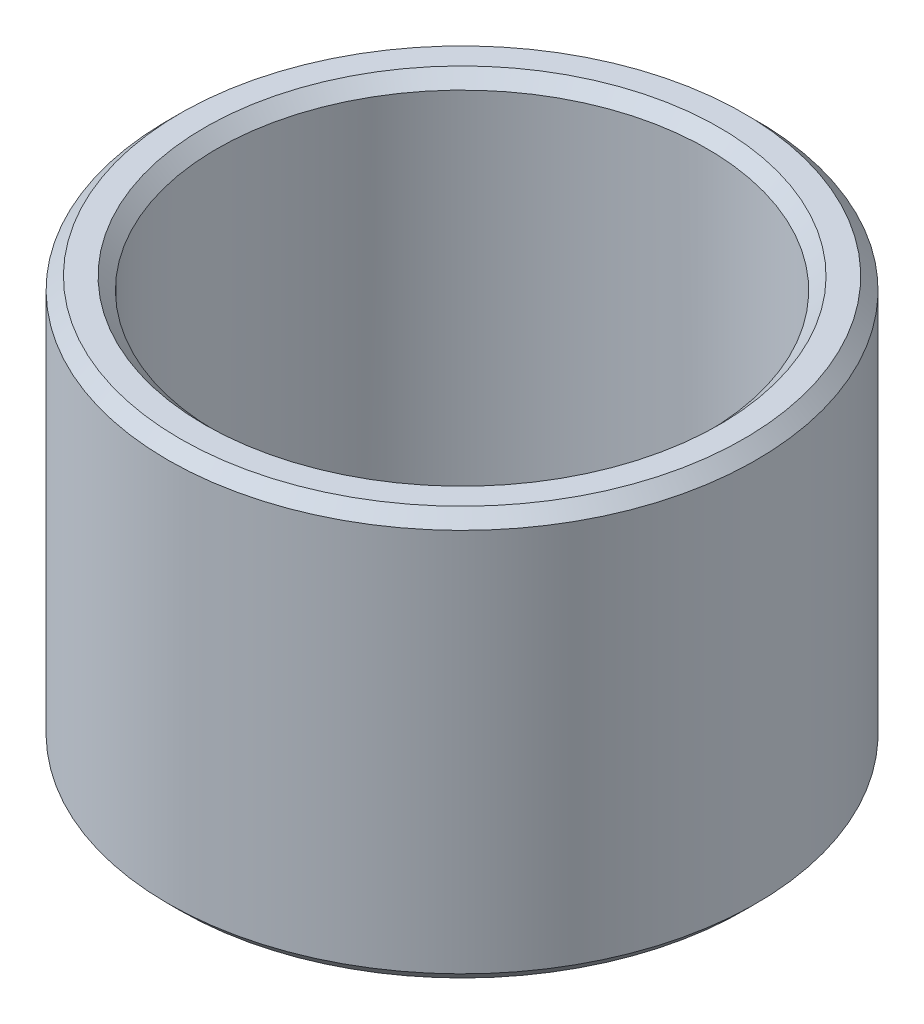
ISO-10303-21;
HEADER;
FILE_DESCRIPTION(('STEP AP214'),'2;1');
FILE_NAME('part.step','',(''),(''),'','','');
FILE_SCHEMA(('AUTOMOTIVE_DESIGN { 1 0 10303 214 1 1 1 1 }'));
ENDSEC;
DATA;
#1=APPLICATION_CONTEXT('core data for automotive mechanical design processes');
#2=APPLICATION_PROTOCOL_DEFINITION('international standard','automotive_design',2000,#1);
#3=PRODUCT_CONTEXT('',#1,'mechanical');
#4=PRODUCT('Part','Part','',(#3));
#5=PRODUCT_RELATED_PRODUCT_CATEGORY('part','',(#4));
#6=PRODUCT_DEFINITION_FORMATION('','',#4);
#7=PRODUCT_DEFINITION_CONTEXT('part definition',#1,'design');
#8=PRODUCT_DEFINITION('design','',#6,#7);
#9=PRODUCT_DEFINITION_SHAPE('','',#8);
#10=(LENGTH_UNIT() NAMED_UNIT(*) SI_UNIT(.MILLI.,.METRE.));
#11=(NAMED_UNIT(*) PLANE_ANGLE_UNIT() SI_UNIT($,.RADIAN.));
#12=(NAMED_UNIT(*) SI_UNIT($,.STERADIAN.) SOLID_ANGLE_UNIT());
#13=UNCERTAINTY_MEASURE_WITH_UNIT(LENGTH_MEASURE(1.E-05),#10,'distance_accuracy_value','');
#14=(GEOMETRIC_REPRESENTATION_CONTEXT(3) GLOBAL_UNCERTAINTY_ASSIGNED_CONTEXT((#13)) GLOBAL_UNIT_ASSIGNED_CONTEXT((#10,
#11,#12)) REPRESENTATION_CONTEXT('',''));
#15=CARTESIAN_POINT('',(0.,0.,0.));
#16=DIRECTION('',(0.,0.,1.));
#17=DIRECTION('',(1.,0.,0.));
#18=AXIS2_PLACEMENT_3D('',#15,#16,#17);
#19=CARTESIAN_POINT('',(0.,0.,0.));
#20=DIRECTION('',(0.,1.,0.));
#21=DIRECTION('',(0.,0.,1.00000000000004));
#22=AXIS2_PLACEMENT_3D('',#19,#20,#21);
#23=CYLINDRICAL_SURFACE('',#22,30.);
#24=CARTESIAN_POINT('',(0.,1.50000340784923,0.));
#25=DIRECTION('',(0.,-1.,0.));
#26=DIRECTION('',(-4.66199278501018E-10,0.,-1.00000000000004));
#27=AXIS2_PLACEMENT_3D('',#24,#25,#26);
#28=CIRCLE('',#27,30.0000034078484);
#29=CARTESIAN_POINT('',(-1.3985979943767E-08,1.50000340784923,-30.0000034078496));
#30=VERTEX_POINT('',#29);
#31=EDGE_CURVE('E32',#30,#30,#28,.T.);
#32=ORIENTED_EDGE('',*,*,#31,.T.);
#33=EDGE_LOOP('',(#32));
#34=FACE_BOUND('',#33,.T.);
#35=CARTESIAN_POINT('',(-1.11022302462516E-13,48.4999965921608,3.05311331771918E-13));
#36=DIRECTION('',(0.,1.,0.));
#37=DIRECTION('',(4.66198757716018E-10,0.,1.00000000000004));
#38=AXIS2_PLACEMENT_3D('',#35,#36,#37);
#39=CIRCLE('',#38,30.0000034078385);
#40=CARTESIAN_POINT('',(1.39858532979081E-08,48.4999965921608,30.0000034078399));
#41=VERTEX_POINT('',#40);
#42=EDGE_CURVE('E29',#41,#41,#39,.T.);
#43=ORIENTED_EDGE('',*,*,#42,.T.);
#44=EDGE_LOOP('',(#43));
#45=FACE_BOUND('',#44,.T.);
#46=ADVANCED_FACE('F14',(#34,#45),#23,.F.);
#47=CARTESIAN_POINT('',(0.,3.57824109231686E-06,0.));
#48=DIRECTION('',(0.,-1.,0.));
#49=DIRECTION('',(0.,0.,-1.00000000000004));
#50=AXIS2_PLACEMENT_3D('',#47,#48,#49);
#51=CONICAL_SURFACE('',#50,31.5000035782403,0.785398276992001);
#52=ORIENTED_EDGE('',*,*,#31,.F.);
#53=EDGE_LOOP('',(#52));
#54=FACE_BOUND('',#53,.T.);
#55=CARTESIAN_POINT('',(0.,0.,0.));
#56=DIRECTION('',(0.,1.,0.));
#57=DIRECTION('',(0.,0.,1.00000000000004));
#58=AXIS2_PLACEMENT_3D('',#55,#56,#57);
#59=CIRCLE('',#58,31.5000071564822);
#60=CARTESIAN_POINT('',(0.,0.,31.5000071564834));
#61=VERTEX_POINT('',#60);
#62=EDGE_CURVE('E17',#61,#61,#59,.F.);
#63=ORIENTED_EDGE('',*,*,#62,.T.);
#64=EDGE_LOOP('',(#63));
#65=FACE_BOUND('',#64,.T.);
#66=ADVANCED_FACE('F46',(#54,#65),#51,.F.);
#67=CARTESIAN_POINT('',(-1.11022302462516E-13,49.9999964217689,3.05311331771918E-13));
#68=DIRECTION('',(0.,1.,0.));
#69=DIRECTION('',(0.,0.,1.00000000000004));
#70=AXIS2_PLACEMENT_3D('',#67,#68,#69);
#71=CONICAL_SURFACE('',#70,31.5000035782302,0.785398276992003);
#72=ORIENTED_EDGE('',*,*,#42,.F.);
#73=EDGE_LOOP('',(#72));
#74=FACE_BOUND('',#73,.T.);
#75=CARTESIAN_POINT('',(-1.11022302462516E-13,50.,3.05311331771918E-13));
#76=DIRECTION('',(0.,1.,0.));
#77=DIRECTION('',(0.,0.,1.00000000000004));
#78=AXIS2_PLACEMENT_3D('',#75,#76,#77);
#79=CIRCLE('',#78,31.5000071564622);
#80=CARTESIAN_POINT('',(-1.11022302462516E-13,50.,31.5000071564637));
#81=VERTEX_POINT('',#80);
#82=EDGE_CURVE('E39',#81,#81,#79,.F.);
#83=ORIENTED_EDGE('',*,*,#82,.F.);
#84=EDGE_LOOP('',(#83));
#85=FACE_BOUND('',#84,.T.);
#86=ADVANCED_FACE('F52',(#74,#85),#71,.F.);
#87=CARTESIAN_POINT('',(0.,0.,0.));
#88=DIRECTION('',(0.,1.,0.));
#89=DIRECTION('',(0.,0.,1.00000000000004));
#90=AXIS2_PLACEMENT_3D('',#87,#88,#89);
#91=PLANE('',#90);
#92=ORIENTED_EDGE('',*,*,#62,.F.);
#93=EDGE_LOOP('',(#92));
#94=FACE_BOUND('',#93,.T.);
#95=CARTESIAN_POINT('',(1.11022302462516E-13,0.,0.));
#96=DIRECTION('',(0.,1.,0.));
#97=DIRECTION('',(0.,0.,1.00000000000004));
#98=AXIS2_PLACEMENT_3D('',#95,#96,#97);
#99=CIRCLE('',#98,34.4999938155875);
#100=CARTESIAN_POINT('',(1.11022302462516E-13,0.,34.4999938155887));
#101=VERTEX_POINT('',#100);
#102=EDGE_CURVE('E37',#101,#101,#99,.T.);
#103=ORIENTED_EDGE('',*,*,#102,.F.);
#104=EDGE_LOOP('',(#103));
#105=FACE_BOUND('',#104,.T.);
#106=ADVANCED_FACE('F48',(#94,#105),#91,.F.);
#107=CARTESIAN_POINT('',(0.,50.,2.63677968348475E-13));
#108=DIRECTION('',(0.,1.,0.));
#109=DIRECTION('',(0.,0.,1.00000000000004));
#110=AXIS2_PLACEMENT_3D('',#107,#108,#109);
#111=PLANE('',#110);
#112=ORIENTED_EDGE('',*,*,#82,.T.);
#113=EDGE_LOOP('',(#112));
#114=FACE_BOUND('',#113,.T.);
#115=CARTESIAN_POINT('',(0.,50.,2.08166817117217E-13));
#116=DIRECTION('',(0.,1.,0.));
#117=DIRECTION('',(0.,0.,1.00000000000004));
#118=AXIS2_PLACEMENT_3D('',#115,#116,#117);
#119=CIRCLE('',#118,34.4999938156362);
#120=CARTESIAN_POINT('',(0.,50.,34.4999938156377));
#121=VERTEX_POINT('',#120);
#122=EDGE_CURVE('E26',#121,#121,#119,.F.);
#123=ORIENTED_EDGE('',*,*,#122,.F.);
#124=EDGE_LOOP('',(#123));
#125=FACE_BOUND('',#124,.T.);
#126=ADVANCED_FACE('F51',(#114,#125),#111,.T.);
#127=CARTESIAN_POINT('',(1.11022302462516E-13,1.50000322640578,0.));
#128=DIRECTION('',(0.,1.,0.));
#129=DIRECTION('',(-1.00000000000004,0.,0.));
#130=AXIS2_PLACEMENT_3D('',#127,#128,#129);
#131=CONICAL_SURFACE('',#130,35.9999967731043,0.785398073768);
#132=CARTESIAN_POINT('',(0.,1.5,0.));
#133=DIRECTION('',(0.,1.,0.));
#134=DIRECTION('',(0.,0.,1.00000000000004));
#135=AXIS2_PLACEMENT_3D('',#132,#133,#134);
#136=CIRCLE('',#135,36.);
#137=CARTESIAN_POINT('',(0.,1.5,36.0000000000014));
#138=VERTEX_POINT('',#137);
#139=EDGE_CURVE('E21',#138,#138,#136,.T.);
#140=ORIENTED_EDGE('',*,*,#139,.F.);
#141=EDGE_LOOP('',(#140));
#142=FACE_BOUND('',#141,.T.);
#143=ORIENTED_EDGE('',*,*,#102,.T.);
#144=EDGE_LOOP('',(#143));
#145=FACE_BOUND('',#144,.T.);
#146=ADVANCED_FACE('F56',(#142,#145),#131,.T.);
#147=CARTESIAN_POINT('',(0.,48.4999967733739,2.08166817117217E-13));
#148=DIRECTION('',(0.,-1.,0.));
#149=DIRECTION('',(0.,0.,-1.00000000000004));
#150=AXIS2_PLACEMENT_3D('',#147,#148,#149);
#151=CONICAL_SURFACE('',#150,35.9999967733733,0.785398073767996);
#152=CARTESIAN_POINT('',(0.,48.5,2.63677968348475E-13));
#153=DIRECTION('',(0.,1.,0.));
#154=DIRECTION('',(0.,0.,1.00000000000004));
#155=AXIS2_PLACEMENT_3D('',#152,#153,#154);
#156=CIRCLE('',#155,36.);
#157=CARTESIAN_POINT('',(0.,48.5,36.0000000000017));
#158=VERTEX_POINT('',#157);
#159=EDGE_CURVE('E10',#158,#158,#156,.F.);
#160=ORIENTED_EDGE('',*,*,#159,.F.);
#161=EDGE_LOOP('',(#160));
#162=FACE_BOUND('',#161,.T.);
#163=ORIENTED_EDGE('',*,*,#122,.T.);
#164=EDGE_LOOP('',(#163));
#165=FACE_BOUND('',#164,.T.);
#166=ADVANCED_FACE('F58',(#162,#165),#151,.T.);
#167=CARTESIAN_POINT('',(0.,0.,0.));
#168=DIRECTION('',(0.,1.,0.));
#169=DIRECTION('',(0.,0.,1.00000000000004));
#170=AXIS2_PLACEMENT_3D('',#167,#168,#169);
#171=CYLINDRICAL_SURFACE('',#170,36.);
#172=ORIENTED_EDGE('',*,*,#139,.T.);
#173=EDGE_LOOP('',(#172));
#174=FACE_BOUND('',#173,.T.);
#175=ORIENTED_EDGE('',*,*,#159,.T.);
#176=EDGE_LOOP('',(#175));
#177=FACE_BOUND('',#176,.T.);
#178=ADVANCED_FACE('F66',(#174,#177),#171,.T.);
#179=CLOSED_SHELL('',(#46,#66,#86,#106,#126,#146,#166,#178));
#180=MANIFOLD_SOLID_BREP('B1',#179);
#181=ADVANCED_BREP_SHAPE_REPRESENTATION('',(#18,#180),#14);
#182=SHAPE_DEFINITION_REPRESENTATION(#9,#181);
ENDSEC;
END-ISO-10303-21;
